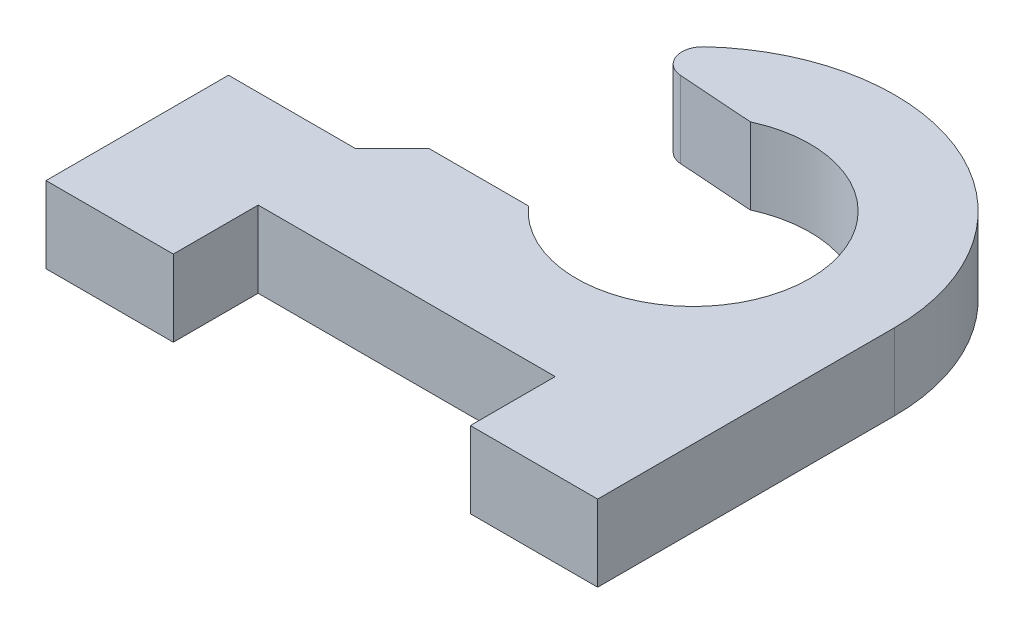
ISO-10303-21;
HEADER;
FILE_DESCRIPTION(('STEP AP214'),'2;1');
FILE_NAME('part.step','',(''),(''),'','','');
FILE_SCHEMA(('AUTOMOTIVE_DESIGN { 1 0 10303 214 1 1 1 1 }'));
ENDSEC;
DATA;
#1=APPLICATION_CONTEXT('core data for automotive mechanical design processes');
#2=APPLICATION_PROTOCOL_DEFINITION('international standard','automotive_design',2000,#1);
#3=PRODUCT_CONTEXT('',#1,'mechanical');
#4=PRODUCT('Part','Part','',(#3));
#5=PRODUCT_RELATED_PRODUCT_CATEGORY('part','',(#4));
#6=PRODUCT_DEFINITION_FORMATION('','',#4);
#7=PRODUCT_DEFINITION_CONTEXT('part definition',#1,'design');
#8=PRODUCT_DEFINITION('design','',#6,#7);
#9=PRODUCT_DEFINITION_SHAPE('','',#8);
#10=(LENGTH_UNIT() NAMED_UNIT(*) SI_UNIT(.MILLI.,.METRE.));
#11=(NAMED_UNIT(*) PLANE_ANGLE_UNIT() SI_UNIT($,.RADIAN.));
#12=(NAMED_UNIT(*) SI_UNIT($,.STERADIAN.) SOLID_ANGLE_UNIT());
#13=UNCERTAINTY_MEASURE_WITH_UNIT(LENGTH_MEASURE(1.E-05),#10,'distance_accuracy_value','');
#14=(GEOMETRIC_REPRESENTATION_CONTEXT(3) GLOBAL_UNCERTAINTY_ASSIGNED_CONTEXT((#13)) GLOBAL_UNIT_ASSIGNED_CONTEXT((#10,
#11,#12)) REPRESENTATION_CONTEXT('',''));
#15=CARTESIAN_POINT('',(0.,0.,0.));
#16=DIRECTION('',(0.,0.,1.));
#17=DIRECTION('',(1.,0.,0.));
#18=AXIS2_PLACEMENT_3D('',#15,#16,#17);
#19=CARTESIAN_POINT('',(0.,1.8,0.));
#20=DIRECTION('',(0.,1.,0.));
#21=DIRECTION('',(0.,0.,1.));
#22=AXIS2_PLACEMENT_3D('',#19,#20,#21);
#23=PLANE('',#22);
#24=CARTESIAN_POINT('',(0.,1.8,0.));
#25=DIRECTION('',(0.,1.,0.));
#26=DIRECTION('',(0.,0.,1.));
#27=AXIS2_PLACEMENT_3D('',#24,#25,#26);
#28=CIRCLE('',#27,4.75);
#29=CARTESIAN_POINT('',(4.75,1.8,0.));
#30=VERTEX_POINT('',#29);
#31=CARTESIAN_POINT('',(-3.22419321597198,1.8,-3.488133900251));
#32=VERTEX_POINT('',#31);
#33=EDGE_CURVE('E156',#30,#32,#28,.T.);
#34=ORIENTED_EDGE('',*,*,#33,.T.);
#35=CARTESIAN_POINT('',(-2.88480445639598,1.8,-3.12096191075089));
#36=DIRECTION('',(0.,1.,0.));
#37=DIRECTION('',(0.,0.,1.));
#38=AXIS2_PLACEMENT_3D('',#35,#36,#37);
#39=CIRCLE('',#38,0.5);
#40=CARTESIAN_POINT('',(-2.91968269326804,1.8,-2.62217988562098));
#41=VERTEX_POINT('',#40);
#42=EDGE_CURVE('E55',#32,#41,#39,.T.);
#43=ORIENTED_EDGE('',*,*,#42,.T.);
#44=DIRECTION('',(-0.997564050259825,0.,-0.0697564737441214));
#45=VECTOR('',#44,1.);
#46=CARTESIAN_POINT('',(-5.,1.8,-2.76764984271165));
#47=LINE('',#46,#45);
#48=CARTESIAN_POINT('',(-1.1491842680833,1.8,-2.49837457519681));
#49=VERTEX_POINT('',#48);
#50=EDGE_CURVE('E150',#49,#41,#47,.T.);
#51=ORIENTED_EDGE('',*,*,#50,.F.);
#52=CARTESIAN_POINT('',(0.,1.8,0.));
#53=DIRECTION('',(0.,1.,0.));
#54=DIRECTION('',(0.,0.,1.));
#55=AXIS2_PLACEMENT_3D('',#52,#53,#54);
#56=CIRCLE('',#55,2.75);
#57=CARTESIAN_POINT('',(-2.05060793451243,1.8,1.83235015728835));
#58=VERTEX_POINT('',#57);
#59=EDGE_CURVE('E149',#58,#49,#56,.T.);
#60=ORIENTED_EDGE('',*,*,#59,.F.);
#61=DIRECTION('',(1.,0.,0.));
#62=VECTOR('',#61,1.);
#63=CARTESIAN_POINT('',(-5.,1.8,1.83235015728835));
#64=LINE('',#63,#62);
#65=CARTESIAN_POINT('',(-4.38235015728836,1.8,1.83235015728835));
#66=VERTEX_POINT('',#65);
#67=EDGE_CURVE('E135',#66,#58,#64,.T.);
#68=ORIENTED_EDGE('',*,*,#67,.F.);
#69=DIRECTION('',(-0.707106781186541,0.,0.707106781186554));
#70=VECTOR('',#69,1.);
#71=CARTESIAN_POINT('',(-5.25,1.8,2.7));
#72=LINE('',#71,#70);
#73=CARTESIAN_POINT('',(-5.25,1.8,2.7));
#74=VERTEX_POINT('',#73);
#75=EDGE_CURVE('E146',#66,#74,#72,.T.);
#76=ORIENTED_EDGE('',*,*,#75,.T.);
#77=DIRECTION('',(-1.,0.,0.));
#78=VECTOR('',#77,1.);
#79=CARTESIAN_POINT('',(-8.25,1.8,2.7));
#80=LINE('',#79,#78);
#81=CARTESIAN_POINT('',(-8.25,1.8,2.7));
#82=VERTEX_POINT('',#81);
#83=EDGE_CURVE('E155',#74,#82,#80,.T.);
#84=ORIENTED_EDGE('',*,*,#83,.T.);
#85=DIRECTION('',(0.,0.,1.));
#86=VECTOR('',#85,1.);
#87=CARTESIAN_POINT('',(-8.25,1.8,5.));
#88=LINE('',#87,#86);
#89=CARTESIAN_POINT('',(-8.25,1.8,7.));
#90=VERTEX_POINT('',#89);
#91=EDGE_CURVE('E158',#82,#90,#88,.T.);
#92=ORIENTED_EDGE('',*,*,#91,.T.);
#93=DIRECTION('',(1.,0.,0.));
#94=VECTOR('',#93,1.);
#95=CARTESIAN_POINT('',(-8.25,1.8,7.));
#96=LINE('',#95,#94);
#97=CARTESIAN_POINT('',(-5.25,1.8,7.));
#98=VERTEX_POINT('',#97);
#99=EDGE_CURVE('E165',#90,#98,#96,.T.);
#100=ORIENTED_EDGE('',*,*,#99,.T.);
#101=DIRECTION('',(0.,0.,-1.));
#102=VECTOR('',#101,1.);
#103=CARTESIAN_POINT('',(-5.25,1.8,5.));
#104=LINE('',#103,#102);
#105=CARTESIAN_POINT('',(-5.25,1.8,5.));
#106=VERTEX_POINT('',#105);
#107=EDGE_CURVE('E192',#98,#106,#104,.T.);
#108=ORIENTED_EDGE('',*,*,#107,.T.);
#109=DIRECTION('',(1.,0.,0.));
#110=VECTOR('',#109,1.);
#111=CARTESIAN_POINT('',(1.75,1.8,5.));
#112=LINE('',#111,#110);
#113=CARTESIAN_POINT('',(1.75,1.8,5.));
#114=VERTEX_POINT('',#113);
#115=EDGE_CURVE('E299',#106,#114,#112,.T.);
#116=ORIENTED_EDGE('',*,*,#115,.T.);
#117=DIRECTION('',(0.,0.,1.));
#118=VECTOR('',#117,1.);
#119=CARTESIAN_POINT('',(1.75,1.8,5.));
#120=LINE('',#119,#118);
#121=CARTESIAN_POINT('',(1.75,1.8,7.));
#122=VERTEX_POINT('',#121);
#123=EDGE_CURVE('E302',#114,#122,#120,.T.);
#124=ORIENTED_EDGE('',*,*,#123,.T.);
#125=DIRECTION('',(1.,0.,0.));
#126=VECTOR('',#125,1.);
#127=CARTESIAN_POINT('',(4.75,1.8,7.));
#128=LINE('',#127,#126);
#129=CARTESIAN_POINT('',(4.75,1.8,7.));
#130=VERTEX_POINT('',#129);
#131=EDGE_CURVE('E233',#122,#130,#128,.T.);
#132=ORIENTED_EDGE('',*,*,#131,.T.);
#133=DIRECTION('',(0.,0.,-1.));
#134=VECTOR('',#133,1.);
#135=CARTESIAN_POINT('',(4.75,1.8,5.));
#136=LINE('',#135,#134);
#137=EDGE_CURVE('E160',#130,#30,#136,.T.);
#138=ORIENTED_EDGE('',*,*,#137,.T.);
#139=EDGE_LOOP('',(#34,#43,#51,#60,#68,#76,#84,#92,#100,#108,#116,#124,#132,#138));
#140=FACE_BOUND('',#139,.T.);
#141=ADVANCED_FACE('F33',(#140),#23,.T.);
#142=CARTESIAN_POINT('',(0.,0.,0.));
#143=DIRECTION('',(0.,1.,0.));
#144=DIRECTION('',(0.,0.,1.));
#145=AXIS2_PLACEMENT_3D('',#142,#143,#144);
#146=PLANE('',#145);
#147=DIRECTION('',(-0.997564050259825,0.,-0.0697564737441214));
#148=VECTOR('',#147,1.);
#149=CARTESIAN_POINT('',(-5.,0.,-2.76764984271165));
#150=LINE('',#149,#148);
#151=CARTESIAN_POINT('',(-1.1491842680833,0.,-2.49837457519681));
#152=VERTEX_POINT('',#151);
#153=CARTESIAN_POINT('',(-2.91968269326804,0.,-2.62217988562098));
#154=VERTEX_POINT('',#153);
#155=EDGE_CURVE('E241',#152,#154,#150,.T.);
#156=ORIENTED_EDGE('',*,*,#155,.T.);
#157=CARTESIAN_POINT('',(-2.88480445639598,0.,-3.12096191075089));
#158=DIRECTION('',(0.,1.,0.));
#159=DIRECTION('',(0.,0.,1.));
#160=AXIS2_PLACEMENT_3D('',#157,#158,#159);
#161=CIRCLE('',#160,0.5);
#162=CARTESIAN_POINT('',(-3.22419321597198,0.,-3.488133900251));
#163=VERTEX_POINT('',#162);
#164=EDGE_CURVE('E11',#154,#163,#161,.F.);
#165=ORIENTED_EDGE('',*,*,#164,.T.);
#166=CARTESIAN_POINT('',(0.,0.,0.));
#167=DIRECTION('',(0.,1.,0.));
#168=DIRECTION('',(0.,0.,1.));
#169=AXIS2_PLACEMENT_3D('',#166,#167,#168);
#170=CIRCLE('',#169,4.75);
#171=CARTESIAN_POINT('',(4.75,0.,0.));
#172=VERTEX_POINT('',#171);
#173=EDGE_CURVE('E180',#172,#163,#170,.T.);
#174=ORIENTED_EDGE('',*,*,#173,.F.);
#175=DIRECTION('',(0.,0.,-1.));
#176=VECTOR('',#175,1.);
#177=CARTESIAN_POINT('',(4.75,0.,0.));
#178=LINE('',#177,#176);
#179=CARTESIAN_POINT('',(4.75,0.,7.));
#180=VERTEX_POINT('',#179);
#181=EDGE_CURVE('E178',#180,#172,#178,.T.);
#182=ORIENTED_EDGE('',*,*,#181,.F.);
#183=DIRECTION('',(1.,0.,0.));
#184=VECTOR('',#183,1.);
#185=CARTESIAN_POINT('',(4.75,0.,7.));
#186=LINE('',#185,#184);
#187=CARTESIAN_POINT('',(1.75,0.,7.));
#188=VERTEX_POINT('',#187);
#189=EDGE_CURVE('E175',#188,#180,#186,.T.);
#190=ORIENTED_EDGE('',*,*,#189,.F.);
#191=DIRECTION('',(0.,0.,1.));
#192=VECTOR('',#191,1.);
#193=CARTESIAN_POINT('',(1.75,0.,5.));
#194=LINE('',#193,#192);
#195=CARTESIAN_POINT('',(1.75,0.,5.));
#196=VERTEX_POINT('',#195);
#197=EDGE_CURVE('E173',#196,#188,#194,.T.);
#198=ORIENTED_EDGE('',*,*,#197,.F.);
#199=DIRECTION('',(1.,0.,0.));
#200=VECTOR('',#199,1.);
#201=CARTESIAN_POINT('',(1.75,0.,5.));
#202=LINE('',#201,#200);
#203=CARTESIAN_POINT('',(-5.25,0.,5.));
#204=VERTEX_POINT('',#203);
#205=EDGE_CURVE('E171',#204,#196,#202,.T.);
#206=ORIENTED_EDGE('',*,*,#205,.F.);
#207=DIRECTION('',(0.,0.,-1.));
#208=VECTOR('',#207,1.);
#209=CARTESIAN_POINT('',(-5.25,0.,5.));
#210=LINE('',#209,#208);
#211=CARTESIAN_POINT('',(-5.25,0.,7.));
#212=VERTEX_POINT('',#211);
#213=EDGE_CURVE('E168',#212,#204,#210,.T.);
#214=ORIENTED_EDGE('',*,*,#213,.F.);
#215=DIRECTION('',(1.,0.,0.));
#216=VECTOR('',#215,1.);
#217=CARTESIAN_POINT('',(-8.25,0.,7.));
#218=LINE('',#217,#216);
#219=CARTESIAN_POINT('',(-8.25,0.,7.));
#220=VERTEX_POINT('',#219);
#221=EDGE_CURVE('E190',#220,#212,#218,.T.);
#222=ORIENTED_EDGE('',*,*,#221,.F.);
#223=DIRECTION('',(0.,0.,1.));
#224=VECTOR('',#223,1.);
#225=CARTESIAN_POINT('',(-8.25,0.,5.));
#226=LINE('',#225,#224);
#227=CARTESIAN_POINT('',(-8.25,0.,2.7));
#228=VERTEX_POINT('',#227);
#229=EDGE_CURVE('E188',#228,#220,#226,.T.);
#230=ORIENTED_EDGE('',*,*,#229,.F.);
#231=DIRECTION('',(-1.,0.,0.));
#232=VECTOR('',#231,1.);
#233=CARTESIAN_POINT('',(-8.25,0.,2.7));
#234=LINE('',#233,#232);
#235=CARTESIAN_POINT('',(-5.25,0.,2.7));
#236=VERTEX_POINT('',#235);
#237=EDGE_CURVE('E185',#236,#228,#234,.T.);
#238=ORIENTED_EDGE('',*,*,#237,.F.);
#239=DIRECTION('',(-0.707106781186541,0.,0.707106781186554));
#240=VECTOR('',#239,1.);
#241=CARTESIAN_POINT('',(-5.25,0.,2.7));
#242=LINE('',#241,#240);
#243=CARTESIAN_POINT('',(-4.38235015728836,0.,1.83235015728835));
#244=VERTEX_POINT('',#243);
#245=EDGE_CURVE('E183',#244,#236,#242,.T.);
#246=ORIENTED_EDGE('',*,*,#245,.F.);
#247=DIRECTION('',(1.,0.,0.));
#248=VECTOR('',#247,1.);
#249=CARTESIAN_POINT('',(-5.,0.,1.83235015728835));
#250=LINE('',#249,#248);
#251=CARTESIAN_POINT('',(-2.05060793451243,0.,1.83235015728835));
#252=VERTEX_POINT('',#251);
#253=EDGE_CURVE('E138',#244,#252,#250,.T.);
#254=ORIENTED_EDGE('',*,*,#253,.T.);
#255=CARTESIAN_POINT('',(0.,0.,0.));
#256=DIRECTION('',(0.,1.,0.));
#257=DIRECTION('',(0.,0.,1.));
#258=AXIS2_PLACEMENT_3D('',#255,#256,#257);
#259=CIRCLE('',#258,2.75);
#260=EDGE_CURVE('E307',#252,#152,#259,.T.);
#261=ORIENTED_EDGE('',*,*,#260,.T.);
#262=EDGE_LOOP('',(#156,#165,#174,#182,#190,#198,#206,#214,#222,#230,#238,#246,#254,#261));
#263=FACE_BOUND('',#262,.T.);
#264=ADVANCED_FACE('F238',(#263),#146,.F.);
#265=CARTESIAN_POINT('',(-5.25,1.8,5.));
#266=DIRECTION('',(-1.,0.,0.));
#267=DIRECTION('',(0.,0.,1.));
#268=AXIS2_PLACEMENT_3D('',#265,#266,#267);
#269=PLANE('',#268);
#270=ORIENTED_EDGE('',*,*,#213,.T.);
#271=DIRECTION('',(0.,-1.,0.));
#272=VECTOR('',#271,1.);
#273=CARTESIAN_POINT('',(-5.25,1.8,5.));
#274=LINE('',#273,#272);
#275=EDGE_CURVE('E213',#106,#204,#274,.T.);
#276=ORIENTED_EDGE('',*,*,#275,.F.);
#277=ORIENTED_EDGE('',*,*,#107,.F.);
#278=DIRECTION('',(0.,-1.,0.));
#279=VECTOR('',#278,1.);
#280=CARTESIAN_POINT('',(-5.25,1.8,7.));
#281=LINE('',#280,#279);
#282=EDGE_CURVE('E167',#98,#212,#281,.T.);
#283=ORIENTED_EDGE('',*,*,#282,.T.);
#284=EDGE_LOOP('',(#270,#276,#277,#283));
#285=FACE_BOUND('',#284,.T.);
#286=ADVANCED_FACE('F253',(#285),#269,.F.);
#287=CARTESIAN_POINT('',(1.75,1.8,5.));
#288=DIRECTION('',(0.,0.,-1.));
#289=DIRECTION('',(-1.,0.,0.));
#290=AXIS2_PLACEMENT_3D('',#287,#288,#289);
#291=PLANE('',#290);
#292=ORIENTED_EDGE('',*,*,#205,.T.);
#293=DIRECTION('',(0.,-1.,0.));
#294=VECTOR('',#293,1.);
#295=CARTESIAN_POINT('',(1.75,1.8,5.));
#296=LINE('',#295,#294);
#297=EDGE_CURVE('E210',#114,#196,#296,.T.);
#298=ORIENTED_EDGE('',*,*,#297,.F.);
#299=ORIENTED_EDGE('',*,*,#115,.F.);
#300=ORIENTED_EDGE('',*,*,#275,.T.);
#301=EDGE_LOOP('',(#292,#298,#299,#300));
#302=FACE_BOUND('',#301,.T.);
#303=ADVANCED_FACE('F284',(#302),#291,.F.);
#304=CARTESIAN_POINT('',(1.75,1.8,5.));
#305=DIRECTION('',(1.,0.,0.));
#306=DIRECTION('',(0.,0.,-1.));
#307=AXIS2_PLACEMENT_3D('',#304,#305,#306);
#308=PLANE('',#307);
#309=ORIENTED_EDGE('',*,*,#197,.T.);
#310=DIRECTION('',(0.,-1.,0.));
#311=VECTOR('',#310,1.);
#312=CARTESIAN_POINT('',(1.75,1.8,7.));
#313=LINE('',#312,#311);
#314=EDGE_CURVE('E207',#122,#188,#313,.T.);
#315=ORIENTED_EDGE('',*,*,#314,.F.);
#316=ORIENTED_EDGE('',*,*,#123,.F.);
#317=ORIENTED_EDGE('',*,*,#297,.T.);
#318=EDGE_LOOP('',(#309,#315,#316,#317));
#319=FACE_BOUND('',#318,.T.);
#320=ADVANCED_FACE('F280',(#319),#308,.F.);
#321=CARTESIAN_POINT('',(4.75,1.8,7.));
#322=DIRECTION('',(0.,0.,-1.));
#323=DIRECTION('',(-1.,0.,0.));
#324=AXIS2_PLACEMENT_3D('',#321,#322,#323);
#325=PLANE('',#324);
#326=ORIENTED_EDGE('',*,*,#189,.T.);
#327=DIRECTION('',(0.,-1.,0.));
#328=VECTOR('',#327,1.);
#329=CARTESIAN_POINT('',(4.75,1.8,7.));
#330=LINE('',#329,#328);
#331=EDGE_CURVE('E204',#130,#180,#330,.T.);
#332=ORIENTED_EDGE('',*,*,#331,.F.);
#333=ORIENTED_EDGE('',*,*,#131,.F.);
#334=ORIENTED_EDGE('',*,*,#314,.T.);
#335=EDGE_LOOP('',(#326,#332,#333,#334));
#336=FACE_BOUND('',#335,.T.);
#337=ADVANCED_FACE('F277',(#336),#325,.F.);
#338=CARTESIAN_POINT('',(4.75,1.8,0.));
#339=DIRECTION('',(-1.,0.,0.));
#340=DIRECTION('',(0.,0.,1.));
#341=AXIS2_PLACEMENT_3D('',#338,#339,#340);
#342=PLANE('',#341);
#343=ORIENTED_EDGE('',*,*,#181,.T.);
#344=DIRECTION('',(0.,-1.,0.));
#345=VECTOR('',#344,1.);
#346=CARTESIAN_POINT('',(4.75,1.8,0.));
#347=LINE('',#346,#345);
#348=EDGE_CURVE('E142',#30,#172,#347,.T.);
#349=ORIENTED_EDGE('',*,*,#348,.F.);
#350=ORIENTED_EDGE('',*,*,#137,.F.);
#351=ORIENTED_EDGE('',*,*,#331,.T.);
#352=EDGE_LOOP('',(#343,#349,#350,#351));
#353=FACE_BOUND('',#352,.T.);
#354=ADVANCED_FACE('F236',(#353),#342,.F.);
#355=CARTESIAN_POINT('',(0.,1.8,0.));
#356=DIRECTION('',(0.,-1.,0.));
#357=DIRECTION('',(0.,0.,-1.));
#358=AXIS2_PLACEMENT_3D('',#355,#356,#357);
#359=CYLINDRICAL_SURFACE('',#358,4.75);
#360=ORIENTED_EDGE('',*,*,#173,.T.);
#361=DIRECTION('',(0.,-1.,0.));
#362=VECTOR('',#361,1.);
#363=CARTESIAN_POINT('',(-3.22419321597198,1.8,-3.488133900251));
#364=LINE('',#363,#362);
#365=EDGE_CURVE('E220',#163,#32,#364,.F.);
#366=ORIENTED_EDGE('',*,*,#365,.T.);
#367=ORIENTED_EDGE('',*,*,#33,.F.);
#368=ORIENTED_EDGE('',*,*,#348,.T.);
#369=EDGE_LOOP('',(#360,#366,#367,#368));
#370=FACE_BOUND('',#369,.T.);
#371=ADVANCED_FACE('F226',(#370),#359,.T.);
#372=CARTESIAN_POINT('',(-5.25,1.8,2.7));
#373=DIRECTION('',(0.707106781186554,0.,0.707106781186541));
#374=DIRECTION('',(0.707106781186541,0.,-0.707106781186554));
#375=AXIS2_PLACEMENT_3D('',#372,#373,#374);
#376=PLANE('',#375);
#377=ORIENTED_EDGE('',*,*,#245,.T.);
#378=DIRECTION('',(0.,-1.,0.));
#379=VECTOR('',#378,1.);
#380=CARTESIAN_POINT('',(-5.25,1.8,2.7));
#381=LINE('',#380,#379);
#382=EDGE_CURVE('E143',#74,#236,#381,.T.);
#383=ORIENTED_EDGE('',*,*,#382,.F.);
#384=ORIENTED_EDGE('',*,*,#75,.F.);
#385=DIRECTION('',(0.,-1.,0.));
#386=VECTOR('',#385,1.);
#387=CARTESIAN_POINT('',(-4.38235015728836,1.8,1.83235015728835));
#388=LINE('',#387,#386);
#389=EDGE_CURVE('E132',#66,#244,#388,.T.);
#390=ORIENTED_EDGE('',*,*,#389,.T.);
#391=EDGE_LOOP('',(#377,#383,#384,#390));
#392=FACE_BOUND('',#391,.T.);
#393=ADVANCED_FACE('F152',(#392),#376,.F.);
#394=CARTESIAN_POINT('',(-8.25,1.8,2.7));
#395=DIRECTION('',(0.,0.,1.));
#396=DIRECTION('',(1.,0.,0.));
#397=AXIS2_PLACEMENT_3D('',#394,#395,#396);
#398=PLANE('',#397);
#399=ORIENTED_EDGE('',*,*,#237,.T.);
#400=DIRECTION('',(0.,-1.,0.));
#401=VECTOR('',#400,1.);
#402=CARTESIAN_POINT('',(-8.25,1.8,2.7));
#403=LINE('',#402,#401);
#404=EDGE_CURVE('E198',#82,#228,#403,.T.);
#405=ORIENTED_EDGE('',*,*,#404,.F.);
#406=ORIENTED_EDGE('',*,*,#83,.F.);
#407=ORIENTED_EDGE('',*,*,#382,.T.);
#408=EDGE_LOOP('',(#399,#405,#406,#407));
#409=FACE_BOUND('',#408,.T.);
#410=ADVANCED_FACE('F266',(#409),#398,.F.);
#411=CARTESIAN_POINT('',(-8.25,1.8,5.));
#412=DIRECTION('',(1.,0.,0.));
#413=DIRECTION('',(0.,0.,-1.));
#414=AXIS2_PLACEMENT_3D('',#411,#412,#413);
#415=PLANE('',#414);
#416=ORIENTED_EDGE('',*,*,#229,.T.);
#417=DIRECTION('',(0.,-1.,0.));
#418=VECTOR('',#417,1.);
#419=CARTESIAN_POINT('',(-8.25,1.8,7.));
#420=LINE('',#419,#418);
#421=EDGE_CURVE('E195',#90,#220,#420,.T.);
#422=ORIENTED_EDGE('',*,*,#421,.F.);
#423=ORIENTED_EDGE('',*,*,#91,.F.);
#424=ORIENTED_EDGE('',*,*,#404,.T.);
#425=EDGE_LOOP('',(#416,#422,#423,#424));
#426=FACE_BOUND('',#425,.T.);
#427=ADVANCED_FACE('F262',(#426),#415,.F.);
#428=CARTESIAN_POINT('',(-8.25,1.8,7.));
#429=DIRECTION('',(0.,0.,-1.));
#430=DIRECTION('',(-1.,0.,0.));
#431=AXIS2_PLACEMENT_3D('',#428,#429,#430);
#432=PLANE('',#431);
#433=ORIENTED_EDGE('',*,*,#221,.T.);
#434=ORIENTED_EDGE('',*,*,#282,.F.);
#435=ORIENTED_EDGE('',*,*,#99,.F.);
#436=ORIENTED_EDGE('',*,*,#421,.T.);
#437=EDGE_LOOP('',(#433,#434,#435,#436));
#438=FACE_BOUND('',#437,.T.);
#439=ADVANCED_FACE('F259',(#438),#432,.F.);
#440=CARTESIAN_POINT('',(0.,1.8,0.));
#441=DIRECTION('',(0.,-1.,0.));
#442=DIRECTION('',(0.,0.,-1.));
#443=AXIS2_PLACEMENT_3D('',#440,#441,#442);
#444=CYLINDRICAL_SURFACE('',#443,2.75);
#445=DIRECTION('',(0.,-1.,0.));
#446=VECTOR('',#445,1.);
#447=CARTESIAN_POINT('',(-1.1491842680833,1.8,-2.49837457519681));
#448=LINE('',#447,#446);
#449=EDGE_CURVE('E218',#152,#49,#448,.F.);
#450=ORIENTED_EDGE('',*,*,#449,.F.);
#451=ORIENTED_EDGE('',*,*,#260,.F.);
#452=DIRECTION('',(0.,-1.,0.));
#453=VECTOR('',#452,1.);
#454=CARTESIAN_POINT('',(-2.05060793451243,1.8,1.83235015728835));
#455=LINE('',#454,#453);
#456=EDGE_CURVE('E216',#58,#252,#455,.T.);
#457=ORIENTED_EDGE('',*,*,#456,.F.);
#458=ORIENTED_EDGE('',*,*,#59,.T.);
#459=EDGE_LOOP('',(#450,#451,#457,#458));
#460=FACE_BOUND('',#459,.T.);
#461=ADVANCED_FACE('F256',(#460),#444,.F.);
#462=CARTESIAN_POINT('',(-5.,0.,1.83235015728835));
#463=DIRECTION('',(0.,0.,1.));
#464=DIRECTION('',(1.,0.,0.));
#465=AXIS2_PLACEMENT_3D('',#462,#463,#464);
#466=PLANE('',#465);
#467=ORIENTED_EDGE('',*,*,#67,.T.);
#468=ORIENTED_EDGE('',*,*,#456,.T.);
#469=ORIENTED_EDGE('',*,*,#253,.F.);
#470=ORIENTED_EDGE('',*,*,#389,.F.);
#471=EDGE_LOOP('',(#467,#468,#469,#470));
#472=FACE_BOUND('',#471,.T.);
#473=ADVANCED_FACE('F134',(#472),#466,.F.);
#474=CARTESIAN_POINT('',(-5.,0.,-2.76764984271165));
#475=DIRECTION('',(0.0697564737441214,0.,-0.997564050259825));
#476=DIRECTION('',(-0.997564050259825,0.,-0.0697564737441214));
#477=AXIS2_PLACEMENT_3D('',#474,#475,#476);
#478=PLANE('',#477);
#479=ORIENTED_EDGE('',*,*,#50,.T.);
#480=DIRECTION('',(0.,-1.,0.));
#481=VECTOR('',#480,1.);
#482=CARTESIAN_POINT('',(-2.91968269326804,0.,-2.62217988562098));
#483=LINE('',#482,#481);
#484=EDGE_CURVE('E41',#41,#154,#483,.T.);
#485=ORIENTED_EDGE('',*,*,#484,.T.);
#486=ORIENTED_EDGE('',*,*,#155,.F.);
#487=ORIENTED_EDGE('',*,*,#449,.T.);
#488=EDGE_LOOP('',(#479,#485,#486,#487));
#489=FACE_BOUND('',#488,.T.);
#490=ADVANCED_FACE('F243',(#489),#478,.F.);
#491=CARTESIAN_POINT('',(-2.88480445639598,1.8,-3.12096191075089));
#492=DIRECTION('',(0.,-1.,0.));
#493=DIRECTION('',(0.,0.,-1.));
#494=AXIS2_PLACEMENT_3D('',#491,#492,#493);
#495=CYLINDRICAL_SURFACE('',#494,0.5);
#496=ORIENTED_EDGE('',*,*,#164,.F.);
#497=ORIENTED_EDGE('',*,*,#484,.F.);
#498=ORIENTED_EDGE('',*,*,#42,.F.);
#499=ORIENTED_EDGE('',*,*,#365,.F.);
#500=EDGE_LOOP('',(#496,#497,#498,#499));
#501=FACE_BOUND('',#500,.T.);
#502=ADVANCED_FACE('F35',(#501),#495,.T.);
#503=CLOSED_SHELL('',(#141,#264,#286,#303,#320,#337,#354,#371,#393,#410,#427,#439,#461,#473,
#490,#502));
#504=MANIFOLD_SOLID_BREP('B2',#503);
#505=ADVANCED_BREP_SHAPE_REPRESENTATION('',(#18,#504),#14);
#506=SHAPE_DEFINITION_REPRESENTATION(#9,#505);
ENDSEC;
END-ISO-10303-21;
